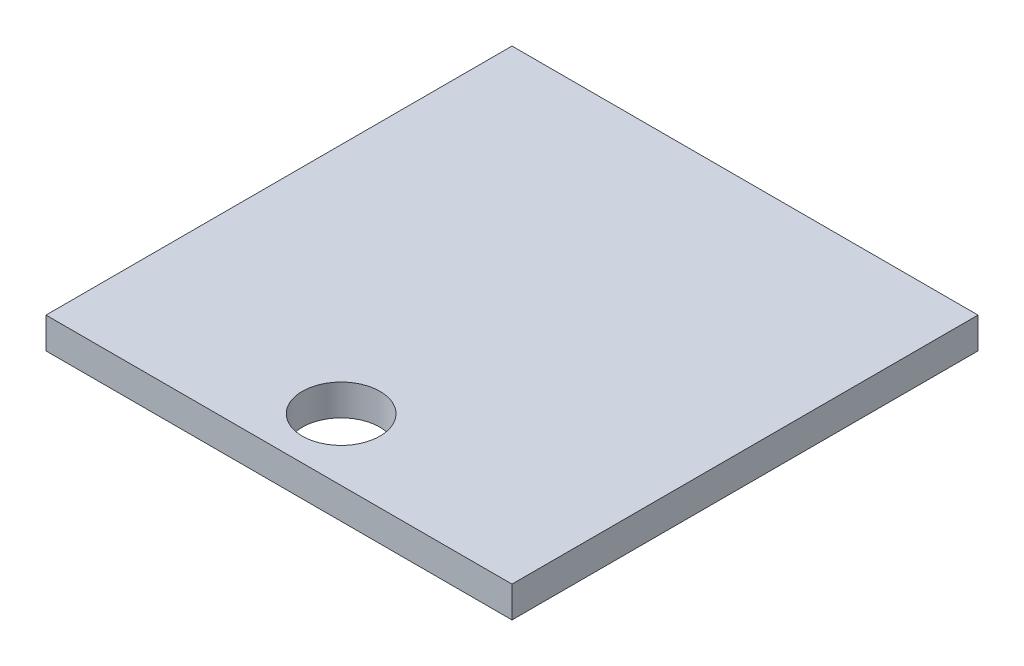
ISO-10303-21;
HEADER;
FILE_DESCRIPTION(('STEP AP214'),'2;1');
FILE_NAME('part.step','',(''),(''),'','','');
FILE_SCHEMA(('AUTOMOTIVE_DESIGN { 1 0 10303 214 1 1 1 1 }'));
ENDSEC;
DATA;
#1=APPLICATION_CONTEXT('core data for automotive mechanical design processes');
#2=APPLICATION_PROTOCOL_DEFINITION('international standard','automotive_design',2000,#1);
#3=PRODUCT_CONTEXT('',#1,'mechanical');
#4=PRODUCT('Part','Part','',(#3));
#5=PRODUCT_RELATED_PRODUCT_CATEGORY('part','',(#4));
#6=PRODUCT_DEFINITION_FORMATION('','',#4);
#7=PRODUCT_DEFINITION_CONTEXT('part definition',#1,'design');
#8=PRODUCT_DEFINITION('design','',#6,#7);
#9=PRODUCT_DEFINITION_SHAPE('','',#8);
#10=(LENGTH_UNIT() NAMED_UNIT(*) SI_UNIT(.MILLI.,.METRE.));
#11=(NAMED_UNIT(*) PLANE_ANGLE_UNIT() SI_UNIT($,.RADIAN.));
#12=(NAMED_UNIT(*) SI_UNIT($,.STERADIAN.) SOLID_ANGLE_UNIT());
#13=UNCERTAINTY_MEASURE_WITH_UNIT(LENGTH_MEASURE(1.E-05),#10,'distance_accuracy_value','');
#14=(GEOMETRIC_REPRESENTATION_CONTEXT(3) GLOBAL_UNCERTAINTY_ASSIGNED_CONTEXT((#13)) GLOBAL_UNIT_ASSIGNED_CONTEXT((#10,
#11,#12)) REPRESENTATION_CONTEXT('',''));
#15=CARTESIAN_POINT('',(0.,0.,0.));
#16=DIRECTION('',(0.,0.,1.));
#17=DIRECTION('',(1.,0.,0.));
#18=AXIS2_PLACEMENT_3D('',#15,#16,#17);
#19=CARTESIAN_POINT('',(0.,1.,0.));
#20=DIRECTION('',(0.,1.,0.));
#21=DIRECTION('',(0.,0.,1.));
#22=AXIS2_PLACEMENT_3D('',#19,#20,#21);
#23=PLANE('',#22);
#24=DIRECTION('',(0.,0.,-1.));
#25=VECTOR('',#24,1.);
#26=CARTESIAN_POINT('',(7.5,1.,-7.5));
#27=LINE('',#26,#25);
#28=CARTESIAN_POINT('',(7.5,1.,7.5));
#29=VERTEX_POINT('',#28);
#30=CARTESIAN_POINT('',(7.5,1.,-7.5));
#31=VERTEX_POINT('',#30);
#32=EDGE_CURVE('E89',#29,#31,#27,.T.);
#33=ORIENTED_EDGE('',*,*,#32,.T.);
#34=DIRECTION('',(-1.,0.,0.));
#35=VECTOR('',#34,1.);
#36=CARTESIAN_POINT('',(-7.5,1.,-7.5));
#37=LINE('',#36,#35);
#38=CARTESIAN_POINT('',(-7.5,1.,-7.5));
#39=VERTEX_POINT('',#38);
#40=EDGE_CURVE('E84',#31,#39,#37,.T.);
#41=ORIENTED_EDGE('',*,*,#40,.T.);
#42=DIRECTION('',(0.,0.,1.));
#43=VECTOR('',#42,1.);
#44=CARTESIAN_POINT('',(-7.5,1.,-7.5));
#45=LINE('',#44,#43);
#46=CARTESIAN_POINT('',(-7.5,1.,7.5));
#47=VERTEX_POINT('',#46);
#48=EDGE_CURVE('E87',#39,#47,#45,.T.);
#49=ORIENTED_EDGE('',*,*,#48,.T.);
#50=DIRECTION('',(1.,0.,0.));
#51=VECTOR('',#50,1.);
#52=CARTESIAN_POINT('',(-7.5,1.,7.5));
#53=LINE('',#52,#51);
#54=EDGE_CURVE('E54',#47,#29,#53,.T.);
#55=ORIENTED_EDGE('',*,*,#54,.T.);
#56=EDGE_LOOP('',(#33,#41,#49,#55));
#57=FACE_BOUND('',#56,.T.);
#58=CARTESIAN_POINT('',(0.,1.,5.5));
#59=DIRECTION('',(0.,1.,0.));
#60=DIRECTION('',(0.,0.,1.));
#61=AXIS2_PLACEMENT_3D('',#58,#59,#60);
#62=CIRCLE('',#61,1.25);
#63=CARTESIAN_POINT('',(0.,1.,6.75));
#64=VERTEX_POINT('',#63);
#65=EDGE_CURVE('E104',#64,#64,#62,.T.);
#66=ORIENTED_EDGE('',*,*,#65,.F.);
#67=EDGE_LOOP('',(#66));
#68=FACE_BOUND('',#67,.T.);
#69=ADVANCED_FACE('F37',(#57,#68),#23,.T.);
#70=CARTESIAN_POINT('',(0.,0.,0.));
#71=DIRECTION('',(0.,1.,0.));
#72=DIRECTION('',(0.,0.,1.));
#73=AXIS2_PLACEMENT_3D('',#70,#71,#72);
#74=PLANE('',#73);
#75=DIRECTION('',(0.,0.,-1.));
#76=VECTOR('',#75,1.);
#77=CARTESIAN_POINT('',(7.5,0.,-7.5));
#78=LINE('',#77,#76);
#79=CARTESIAN_POINT('',(7.5,0.,7.5));
#80=VERTEX_POINT('',#79);
#81=CARTESIAN_POINT('',(7.5,0.,-7.5));
#82=VERTEX_POINT('',#81);
#83=EDGE_CURVE('E101',#80,#82,#78,.T.);
#84=ORIENTED_EDGE('',*,*,#83,.F.);
#85=DIRECTION('',(1.,0.,0.));
#86=VECTOR('',#85,1.);
#87=CARTESIAN_POINT('',(-7.5,0.,7.5));
#88=LINE('',#87,#86);
#89=CARTESIAN_POINT('',(-7.5,0.,7.5));
#90=VERTEX_POINT('',#89);
#91=EDGE_CURVE('E77',#90,#80,#88,.T.);
#92=ORIENTED_EDGE('',*,*,#91,.F.);
#93=DIRECTION('',(0.,0.,1.));
#94=VECTOR('',#93,1.);
#95=CARTESIAN_POINT('',(-7.5,0.,-7.5));
#96=LINE('',#95,#94);
#97=CARTESIAN_POINT('',(-7.5,0.,-7.5));
#98=VERTEX_POINT('',#97);
#99=EDGE_CURVE('E71',#98,#90,#96,.T.);
#100=ORIENTED_EDGE('',*,*,#99,.F.);
#101=DIRECTION('',(-1.,0.,0.));
#102=VECTOR('',#101,1.);
#103=CARTESIAN_POINT('',(-7.5,0.,-7.5));
#104=LINE('',#103,#102);
#105=EDGE_CURVE('E93',#82,#98,#104,.T.);
#106=ORIENTED_EDGE('',*,*,#105,.F.);
#107=EDGE_LOOP('',(#84,#92,#100,#106));
#108=FACE_BOUND('',#107,.T.);
#109=CARTESIAN_POINT('',(0.,0.,5.5));
#110=DIRECTION('',(0.,1.,0.));
#111=DIRECTION('',(0.,0.,1.));
#112=AXIS2_PLACEMENT_3D('',#109,#110,#111);
#113=CIRCLE('',#112,1.25);
#114=CARTESIAN_POINT('',(0.,0.,6.75));
#115=VERTEX_POINT('',#114);
#116=EDGE_CURVE('E116',#115,#115,#113,.T.);
#117=ORIENTED_EDGE('',*,*,#116,.T.);
#118=EDGE_LOOP('',(#117));
#119=FACE_BOUND('',#118,.T.);
#120=ADVANCED_FACE('F112',(#108,#119),#74,.F.);
#121=CARTESIAN_POINT('',(7.5,1.,-7.5));
#122=DIRECTION('',(-1.,0.,0.));
#123=DIRECTION('',(0.,0.,1.));
#124=AXIS2_PLACEMENT_3D('',#121,#122,#123);
#125=PLANE('',#124);
#126=ORIENTED_EDGE('',*,*,#83,.T.);
#127=DIRECTION('',(0.,-1.,0.));
#128=VECTOR('',#127,1.);
#129=CARTESIAN_POINT('',(7.5,1.,-7.5));
#130=LINE('',#129,#128);
#131=EDGE_CURVE('E11',#31,#82,#130,.T.);
#132=ORIENTED_EDGE('',*,*,#131,.F.);
#133=ORIENTED_EDGE('',*,*,#32,.F.);
#134=DIRECTION('',(0.,-1.,0.));
#135=VECTOR('',#134,1.);
#136=CARTESIAN_POINT('',(7.5,1.,7.5));
#137=LINE('',#136,#135);
#138=EDGE_CURVE('E97',#29,#80,#137,.T.);
#139=ORIENTED_EDGE('',*,*,#138,.T.);
#140=EDGE_LOOP('',(#126,#132,#133,#139));
#141=FACE_BOUND('',#140,.T.);
#142=ADVANCED_FACE('F39',(#141),#125,.F.);
#143=CARTESIAN_POINT('',(-7.5,1.,-7.5));
#144=DIRECTION('',(0.,0.,1.));
#145=DIRECTION('',(1.,0.,0.));
#146=AXIS2_PLACEMENT_3D('',#143,#144,#145);
#147=PLANE('',#146);
#148=ORIENTED_EDGE('',*,*,#105,.T.);
#149=DIRECTION('',(0.,-1.,0.));
#150=VECTOR('',#149,1.);
#151=CARTESIAN_POINT('',(-7.5,1.,-7.5));
#152=LINE('',#151,#150);
#153=EDGE_CURVE('E46',#39,#98,#152,.T.);
#154=ORIENTED_EDGE('',*,*,#153,.F.);
#155=ORIENTED_EDGE('',*,*,#40,.F.);
#156=ORIENTED_EDGE('',*,*,#131,.T.);
#157=EDGE_LOOP('',(#148,#154,#155,#156));
#158=FACE_BOUND('',#157,.T.);
#159=ADVANCED_FACE('F92',(#158),#147,.F.);
#160=CARTESIAN_POINT('',(-7.5,1.,-7.5));
#161=DIRECTION('',(1.,0.,0.));
#162=DIRECTION('',(0.,0.,-1.));
#163=AXIS2_PLACEMENT_3D('',#160,#161,#162);
#164=PLANE('',#163);
#165=ORIENTED_EDGE('',*,*,#99,.T.);
#166=DIRECTION('',(0.,-1.,0.));
#167=VECTOR('',#166,1.);
#168=CARTESIAN_POINT('',(-7.5,1.,7.5));
#169=LINE('',#168,#167);
#170=EDGE_CURVE('E94',#47,#90,#169,.T.);
#171=ORIENTED_EDGE('',*,*,#170,.F.);
#172=ORIENTED_EDGE('',*,*,#48,.F.);
#173=ORIENTED_EDGE('',*,*,#153,.T.);
#174=EDGE_LOOP('',(#165,#171,#172,#173));
#175=FACE_BOUND('',#174,.T.);
#176=ADVANCED_FACE('F95',(#175),#164,.F.);
#177=CARTESIAN_POINT('',(-7.5,1.,7.5));
#178=DIRECTION('',(0.,0.,-1.));
#179=DIRECTION('',(-1.,0.,0.));
#180=AXIS2_PLACEMENT_3D('',#177,#178,#179);
#181=PLANE('',#180);
#182=ORIENTED_EDGE('',*,*,#91,.T.);
#183=ORIENTED_EDGE('',*,*,#138,.F.);
#184=ORIENTED_EDGE('',*,*,#54,.F.);
#185=ORIENTED_EDGE('',*,*,#170,.T.);
#186=EDGE_LOOP('',(#182,#183,#184,#185));
#187=FACE_BOUND('',#186,.T.);
#188=ADVANCED_FACE('F109',(#187),#181,.F.);
#189=CARTESIAN_POINT('',(0.,1.,5.5));
#190=DIRECTION('',(0.,-1.,0.));
#191=DIRECTION('',(0.,0.,-1.));
#192=AXIS2_PLACEMENT_3D('',#189,#190,#191);
#193=CYLINDRICAL_SURFACE('',#192,1.25);
#194=ORIENTED_EDGE('',*,*,#65,.T.);
#195=EDGE_LOOP('',(#194));
#196=FACE_BOUND('',#195,.T.);
#197=ORIENTED_EDGE('',*,*,#116,.F.);
#198=EDGE_LOOP('',(#197));
#199=FACE_BOUND('',#198,.T.);
#200=ADVANCED_FACE('F122',(#196,#199),#193,.F.);
#201=CLOSED_SHELL('',(#69,#120,#142,#159,#176,#188,#200));
#202=MANIFOLD_SOLID_BREP('B2',#201);
#203=ADVANCED_BREP_SHAPE_REPRESENTATION('',(#18,#202),#14);
#204=SHAPE_DEFINITION_REPRESENTATION(#9,#203);
ENDSEC;
END-ISO-10303-21;
